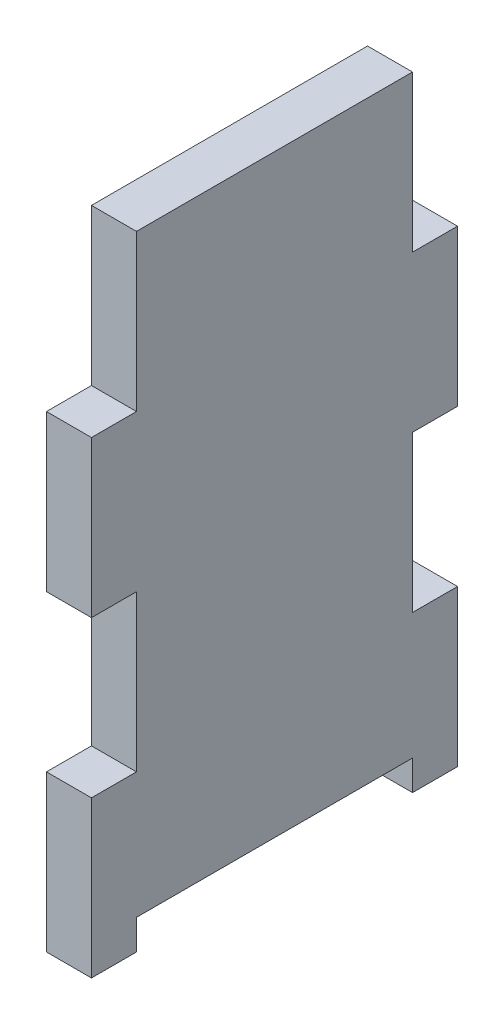
ISO-10303-21;
HEADER;
FILE_DESCRIPTION(('STEP AP214'),'2;1');
FILE_NAME('part.step','',(''),(''),'','','');
FILE_SCHEMA(('AUTOMOTIVE_DESIGN { 1 0 10303 214 1 1 1 1 }'));
ENDSEC;
DATA;
#1=APPLICATION_CONTEXT('core data for automotive mechanical design processes');
#2=APPLICATION_PROTOCOL_DEFINITION('international standard','automotive_design',2000,#1);
#3=PRODUCT_CONTEXT('',#1,'mechanical');
#4=PRODUCT('Part','Part','',(#3));
#5=PRODUCT_RELATED_PRODUCT_CATEGORY('part','',(#4));
#6=PRODUCT_DEFINITION_FORMATION('','',#4);
#7=PRODUCT_DEFINITION_CONTEXT('part definition',#1,'design');
#8=PRODUCT_DEFINITION('design','',#6,#7);
#9=PRODUCT_DEFINITION_SHAPE('','',#8);
#10=(LENGTH_UNIT() NAMED_UNIT(*) SI_UNIT(.MILLI.,.METRE.));
#11=(NAMED_UNIT(*) PLANE_ANGLE_UNIT() SI_UNIT($,.RADIAN.));
#12=(NAMED_UNIT(*) SI_UNIT($,.STERADIAN.) SOLID_ANGLE_UNIT());
#13=UNCERTAINTY_MEASURE_WITH_UNIT(LENGTH_MEASURE(1.E-05),#10,'distance_accuracy_value','');
#14=(GEOMETRIC_REPRESENTATION_CONTEXT(3) GLOBAL_UNCERTAINTY_ASSIGNED_CONTEXT((#13)) GLOBAL_UNIT_ASSIGNED_CONTEXT((#10,
#11,#12)) REPRESENTATION_CONTEXT('',''));
#15=CARTESIAN_POINT('',(0.,0.,0.));
#16=DIRECTION('',(0.,0.,1.));
#17=DIRECTION('',(1.,0.,0.));
#18=AXIS2_PLACEMENT_3D('',#15,#16,#17);
#19=CARTESIAN_POINT('',(9.525,-132.08,0.));
#20=DIRECTION('',(0.,1.,0.));
#21=DIRECTION('',(0.,0.,1.));
#22=AXIS2_PLACEMENT_3D('',#19,#20,#21);
#23=PLANE('',#22);
#24=DIRECTION('',(0.,0.,-1.));
#25=VECTOR('',#24,1.);
#26=CARTESIAN_POINT('',(0.,-132.08,0.));
#27=LINE('',#26,#25);
#28=CARTESIAN_POINT('',(0.,-132.08,0.));
#29=VERTEX_POINT('',#28);
#30=CARTESIAN_POINT('',(0.,-132.08,-9.52500000000001));
#31=VERTEX_POINT('',#30);
#32=EDGE_CURVE('E228',#29,#31,#27,.T.);
#33=ORIENTED_EDGE('',*,*,#32,.T.);
#34=DIRECTION('',(1.,0.,0.));
#35=VECTOR('',#34,1.);
#36=CARTESIAN_POINT('',(-37.465,-132.08,-9.52500000000001));
#37=LINE('',#36,#35);
#38=CARTESIAN_POINT('',(9.525,-132.08,-9.52500000000001));
#39=VERTEX_POINT('',#38);
#40=EDGE_CURVE('E336',#31,#39,#37,.T.);
#41=ORIENTED_EDGE('',*,*,#40,.T.);
#42=DIRECTION('',(0.,0.,-1.));
#43=VECTOR('',#42,1.);
#44=CARTESIAN_POINT('',(9.525,-132.08,0.));
#45=LINE('',#44,#43);
#46=CARTESIAN_POINT('',(9.525,-132.08,0.));
#47=VERTEX_POINT('',#46);
#48=EDGE_CURVE('E364',#47,#39,#45,.T.);
#49=ORIENTED_EDGE('',*,*,#48,.F.);
#50=DIRECTION('',(-1.,0.,0.));
#51=VECTOR('',#50,1.);
#52=CARTESIAN_POINT('',(9.525,-132.08,0.));
#53=LINE('',#52,#51);
#54=EDGE_CURVE('E276',#47,#29,#53,.T.);
#55=ORIENTED_EDGE('',*,*,#54,.T.);
#56=EDGE_LOOP('',(#33,#41,#49,#55));
#57=FACE_BOUND('',#56,.T.);
#58=ADVANCED_FACE('F38',(#57),#23,.F.);
#59=CARTESIAN_POINT('',(9.525,0.,0.));
#60=DIRECTION('',(0.,1.,0.));
#61=DIRECTION('',(0.,0.,1.));
#62=AXIS2_PLACEMENT_3D('',#59,#60,#61);
#63=PLANE('',#62);
#64=DIRECTION('',(0.,0.,-1.));
#65=VECTOR('',#64,1.);
#66=CARTESIAN_POINT('',(0.,0.,0.));
#67=LINE('',#66,#65);
#68=CARTESIAN_POINT('',(0.,0.,-9.525));
#69=VERTEX_POINT('',#68);
#70=CARTESIAN_POINT('',(0.,0.,-67.945));
#71=VERTEX_POINT('',#70);
#72=EDGE_CURVE('E201',#69,#71,#67,.T.);
#73=ORIENTED_EDGE('',*,*,#72,.F.);
#74=DIRECTION('',(-1.,0.,0.));
#75=VECTOR('',#74,1.);
#76=CARTESIAN_POINT('',(9.525,0.,-9.525));
#77=LINE('',#76,#75);
#78=CARTESIAN_POINT('',(9.525,0.,-9.525));
#79=VERTEX_POINT('',#78);
#80=EDGE_CURVE('E123',#79,#69,#77,.T.);
#81=ORIENTED_EDGE('',*,*,#80,.F.);
#82=DIRECTION('',(0.,0.,-1.));
#83=VECTOR('',#82,1.);
#84=CARTESIAN_POINT('',(9.525,0.,0.));
#85=LINE('',#84,#83);
#86=CARTESIAN_POINT('',(9.525,0.,-67.945));
#87=VERTEX_POINT('',#86);
#88=EDGE_CURVE('E254',#79,#87,#85,.T.);
#89=ORIENTED_EDGE('',*,*,#88,.T.);
#90=DIRECTION('',(-1.,0.,0.));
#91=VECTOR('',#90,1.);
#92=CARTESIAN_POINT('',(9.525,0.,-67.945));
#93=LINE('',#92,#91);
#94=EDGE_CURVE('E63',#87,#71,#93,.T.);
#95=ORIENTED_EDGE('',*,*,#94,.T.);
#96=EDGE_LOOP('',(#73,#81,#89,#95));
#97=FACE_BOUND('',#96,.T.);
#98=ADVANCED_FACE('F40',(#97),#63,.T.);
#99=CARTESIAN_POINT('',(9.525,0.,-9.525));
#100=DIRECTION('',(0.,0.,-1.));
#101=DIRECTION('',(0.,1.,0.));
#102=AXIS2_PLACEMENT_3D('',#99,#100,#101);
#103=PLANE('',#102);
#104=DIRECTION('',(0.,-1.,0.));
#105=VECTOR('',#104,1.);
#106=CARTESIAN_POINT('',(0.,0.,-9.525));
#107=LINE('',#106,#105);
#108=CARTESIAN_POINT('',(0.,-33.02,-9.52499999999999));
#109=VERTEX_POINT('',#108);
#110=EDGE_CURVE('E204',#69,#109,#107,.T.);
#111=ORIENTED_EDGE('',*,*,#110,.T.);
#112=DIRECTION('',(-1.,0.,0.));
#113=VECTOR('',#112,1.);
#114=CARTESIAN_POINT('',(9.525,-33.02,-9.52499999999999));
#115=LINE('',#114,#113);
#116=CARTESIAN_POINT('',(9.525,-33.02,-9.52499999999999));
#117=VERTEX_POINT('',#116);
#118=EDGE_CURVE('E296',#117,#109,#115,.T.);
#119=ORIENTED_EDGE('',*,*,#118,.F.);
#120=DIRECTION('',(0.,-1.,0.));
#121=VECTOR('',#120,1.);
#122=CARTESIAN_POINT('',(9.525,0.,-9.525));
#123=LINE('',#122,#121);
#124=EDGE_CURVE('E342',#79,#117,#123,.T.);
#125=ORIENTED_EDGE('',*,*,#124,.F.);
#126=ORIENTED_EDGE('',*,*,#80,.T.);
#127=EDGE_LOOP('',(#111,#119,#125,#126));
#128=FACE_BOUND('',#127,.T.);
#129=ADVANCED_FACE('F443',(#128),#103,.F.);
#130=CARTESIAN_POINT('',(9.525,-33.02,0.));
#131=DIRECTION('',(0.,-1.,0.));
#132=DIRECTION('',(0.,0.,-1.));
#133=AXIS2_PLACEMENT_3D('',#130,#131,#132);
#134=PLANE('',#133);
#135=DIRECTION('',(0.,0.,1.));
#136=VECTOR('',#135,1.);
#137=CARTESIAN_POINT('',(0.,-33.02,0.));
#138=LINE('',#137,#136);
#139=CARTESIAN_POINT('',(0.,-33.02,0.));
#140=VERTEX_POINT('',#139);
#141=EDGE_CURVE('E208',#109,#140,#138,.T.);
#142=ORIENTED_EDGE('',*,*,#141,.T.);
#143=DIRECTION('',(-1.,0.,0.));
#144=VECTOR('',#143,1.);
#145=CARTESIAN_POINT('',(9.525,-33.02,0.));
#146=LINE('',#145,#144);
#147=CARTESIAN_POINT('',(9.525,-33.02,0.));
#148=VERTEX_POINT('',#147);
#149=EDGE_CURVE('E292',#148,#140,#146,.T.);
#150=ORIENTED_EDGE('',*,*,#149,.F.);
#151=DIRECTION('',(0.,0.,1.));
#152=VECTOR('',#151,1.);
#153=CARTESIAN_POINT('',(9.525,-33.02,0.));
#154=LINE('',#153,#152);
#155=EDGE_CURVE('E345',#117,#148,#154,.T.);
#156=ORIENTED_EDGE('',*,*,#155,.F.);
#157=ORIENTED_EDGE('',*,*,#118,.T.);
#158=EDGE_LOOP('',(#142,#150,#156,#157));
#159=FACE_BOUND('',#158,.T.);
#160=ADVANCED_FACE('F459',(#159),#134,.F.);
#161=CARTESIAN_POINT('',(9.525,0.,0.));
#162=DIRECTION('',(0.,0.,-1.));
#163=DIRECTION('',(0.,1.,0.));
#164=AXIS2_PLACEMENT_3D('',#161,#162,#163);
#165=PLANE('',#164);
#166=DIRECTION('',(0.,-1.,0.));
#167=VECTOR('',#166,1.);
#168=CARTESIAN_POINT('',(0.,0.,0.));
#169=LINE('',#168,#167);
#170=CARTESIAN_POINT('',(0.,-66.04,0.));
#171=VERTEX_POINT('',#170);
#172=EDGE_CURVE('E211',#140,#171,#169,.T.);
#173=ORIENTED_EDGE('',*,*,#172,.T.);
#174=DIRECTION('',(-1.,0.,0.));
#175=VECTOR('',#174,1.);
#176=CARTESIAN_POINT('',(9.525,-66.04,0.));
#177=LINE('',#176,#175);
#178=CARTESIAN_POINT('',(9.525,-66.04,0.));
#179=VERTEX_POINT('',#178);
#180=EDGE_CURVE('E289',#179,#171,#177,.T.);
#181=ORIENTED_EDGE('',*,*,#180,.F.);
#182=DIRECTION('',(0.,-1.,0.));
#183=VECTOR('',#182,1.);
#184=CARTESIAN_POINT('',(9.525,0.,0.));
#185=LINE('',#184,#183);
#186=EDGE_CURVE('E348',#148,#179,#185,.T.);
#187=ORIENTED_EDGE('',*,*,#186,.F.);
#188=ORIENTED_EDGE('',*,*,#149,.T.);
#189=EDGE_LOOP('',(#173,#181,#187,#188));
#190=FACE_BOUND('',#189,.T.);
#191=ADVANCED_FACE('F450',(#190),#165,.F.);
#192=CARTESIAN_POINT('',(9.525,-66.04,0.));
#193=DIRECTION('',(0.,-1.,0.));
#194=DIRECTION('',(0.,0.,-1.));
#195=AXIS2_PLACEMENT_3D('',#192,#193,#194);
#196=PLANE('',#195);
#197=DIRECTION('',(0.,0.,1.));
#198=VECTOR('',#197,1.);
#199=CARTESIAN_POINT('',(0.,-66.04,0.));
#200=LINE('',#199,#198);
#201=CARTESIAN_POINT('',(0.,-66.04,-9.52500000000001));
#202=VERTEX_POINT('',#201);
#203=EDGE_CURVE('E215',#202,#171,#200,.T.);
#204=ORIENTED_EDGE('',*,*,#203,.F.);
#205=DIRECTION('',(-1.,0.,0.));
#206=VECTOR('',#205,1.);
#207=CARTESIAN_POINT('',(9.525,-66.04,-9.52500000000001));
#208=LINE('',#207,#206);
#209=CARTESIAN_POINT('',(9.525,-66.04,-9.52500000000001));
#210=VERTEX_POINT('',#209);
#211=EDGE_CURVE('E286',#210,#202,#208,.T.);
#212=ORIENTED_EDGE('',*,*,#211,.F.);
#213=DIRECTION('',(0.,0.,1.));
#214=VECTOR('',#213,1.);
#215=CARTESIAN_POINT('',(9.525,-66.04,0.));
#216=LINE('',#215,#214);
#217=EDGE_CURVE('E351',#210,#179,#216,.T.);
#218=ORIENTED_EDGE('',*,*,#217,.T.);
#219=ORIENTED_EDGE('',*,*,#180,.T.);
#220=EDGE_LOOP('',(#204,#212,#218,#219));
#221=FACE_BOUND('',#220,.T.);
#222=ADVANCED_FACE('F458',(#221),#196,.T.);
#223=CARTESIAN_POINT('',(9.525,0.,-9.52500000000001));
#224=DIRECTION('',(0.,0.,1.));
#225=DIRECTION('',(1.,0.,0.));
#226=AXIS2_PLACEMENT_3D('',#223,#224,#225);
#227=PLANE('',#226);
#228=DIRECTION('',(0.,1.,0.));
#229=VECTOR('',#228,1.);
#230=CARTESIAN_POINT('',(0.,0.,-9.52500000000001));
#231=LINE('',#230,#229);
#232=CARTESIAN_POINT('',(0.,-99.06,-9.52500000000001));
#233=VERTEX_POINT('',#232);
#234=EDGE_CURVE('E220',#233,#202,#231,.T.);
#235=ORIENTED_EDGE('',*,*,#234,.F.);
#236=DIRECTION('',(-1.,0.,0.));
#237=VECTOR('',#236,1.);
#238=CARTESIAN_POINT('',(9.525,-99.06,-9.52500000000001));
#239=LINE('',#238,#237);
#240=CARTESIAN_POINT('',(9.525,-99.06,-9.52500000000001));
#241=VERTEX_POINT('',#240);
#242=EDGE_CURVE('E283',#241,#233,#239,.T.);
#243=ORIENTED_EDGE('',*,*,#242,.F.);
#244=DIRECTION('',(0.,1.,0.));
#245=VECTOR('',#244,1.);
#246=CARTESIAN_POINT('',(9.525,0.,-9.52500000000001));
#247=LINE('',#246,#245);
#248=EDGE_CURVE('E356',#241,#210,#247,.T.);
#249=ORIENTED_EDGE('',*,*,#248,.T.);
#250=ORIENTED_EDGE('',*,*,#211,.T.);
#251=EDGE_LOOP('',(#235,#243,#249,#250));
#252=FACE_BOUND('',#251,.T.);
#253=ADVANCED_FACE('F454',(#252),#227,.T.);
#254=CARTESIAN_POINT('',(9.525,-99.06,0.));
#255=DIRECTION('',(0.,1.,0.));
#256=DIRECTION('',(0.,0.,1.));
#257=AXIS2_PLACEMENT_3D('',#254,#255,#256);
#258=PLANE('',#257);
#259=DIRECTION('',(0.,0.,-1.));
#260=VECTOR('',#259,1.);
#261=CARTESIAN_POINT('',(0.,-99.06,0.));
#262=LINE('',#261,#260);
#263=CARTESIAN_POINT('',(0.,-99.06,0.));
#264=VERTEX_POINT('',#263);
#265=EDGE_CURVE('E224',#264,#233,#262,.T.);
#266=ORIENTED_EDGE('',*,*,#265,.F.);
#267=DIRECTION('',(-1.,0.,0.));
#268=VECTOR('',#267,1.);
#269=CARTESIAN_POINT('',(9.525,-99.06,0.));
#270=LINE('',#269,#268);
#271=CARTESIAN_POINT('',(9.525,-99.06,0.));
#272=VERTEX_POINT('',#271);
#273=EDGE_CURVE('E280',#272,#264,#270,.T.);
#274=ORIENTED_EDGE('',*,*,#273,.F.);
#275=DIRECTION('',(0.,0.,-1.));
#276=VECTOR('',#275,1.);
#277=CARTESIAN_POINT('',(9.525,-99.06,0.));
#278=LINE('',#277,#276);
#279=EDGE_CURVE('E360',#272,#241,#278,.T.);
#280=ORIENTED_EDGE('',*,*,#279,.T.);
#281=ORIENTED_EDGE('',*,*,#242,.T.);
#282=EDGE_LOOP('',(#266,#274,#280,#281));
#283=FACE_BOUND('',#282,.T.);
#284=ADVANCED_FACE('F449',(#283),#258,.T.);
#285=EDGE_CURVE('E216',#264,#29,#169,.T.);
#286=ORIENTED_EDGE('',*,*,#285,.T.);
#287=ORIENTED_EDGE('',*,*,#54,.F.);
#288=EDGE_CURVE('E352',#272,#47,#185,.T.);
#289=ORIENTED_EDGE('',*,*,#288,.F.);
#290=ORIENTED_EDGE('',*,*,#273,.T.);
#291=EDGE_LOOP('',(#286,#287,#289,#290));
#292=FACE_BOUND('',#291,.T.);
#293=ADVANCED_FACE('F393',(#292),#165,.F.);
#294=CARTESIAN_POINT('',(9.525,-132.08,-67.945));
#295=VERTEX_POINT('',#294);
#296=CARTESIAN_POINT('',(9.525,-132.08,-77.47));
#297=VERTEX_POINT('',#296);
#298=EDGE_CURVE('E367',#295,#297,#45,.T.);
#299=ORIENTED_EDGE('',*,*,#298,.F.);
#300=DIRECTION('',(1.,0.,0.));
#301=VECTOR('',#300,1.);
#302=CARTESIAN_POINT('',(-37.465,-132.08,-67.945));
#303=LINE('',#302,#301);
#304=CARTESIAN_POINT('',(0.,-132.08,-67.945));
#305=VERTEX_POINT('',#304);
#306=EDGE_CURVE('E328',#305,#295,#303,.T.);
#307=ORIENTED_EDGE('',*,*,#306,.F.);
#308=CARTESIAN_POINT('',(0.,-132.08,-77.47));
#309=VERTEX_POINT('',#308);
#310=EDGE_CURVE('E233',#305,#309,#27,.T.);
#311=ORIENTED_EDGE('',*,*,#310,.T.);
#312=DIRECTION('',(-1.,0.,0.));
#313=VECTOR('',#312,1.);
#314=CARTESIAN_POINT('',(9.525,-132.08,-77.47));
#315=LINE('',#314,#313);
#316=EDGE_CURVE('E272',#297,#309,#315,.T.);
#317=ORIENTED_EDGE('',*,*,#316,.F.);
#318=EDGE_LOOP('',(#299,#307,#311,#317));
#319=FACE_BOUND('',#318,.T.);
#320=ADVANCED_FACE('F413',(#319),#23,.F.);
#321=CARTESIAN_POINT('',(9.525,0.,-77.47));
#322=DIRECTION('',(0.,0.,-1.));
#323=DIRECTION('',(-1.,0.,0.));
#324=AXIS2_PLACEMENT_3D('',#321,#322,#323);
#325=PLANE('',#324);
#326=DIRECTION('',(0.,-1.,0.));
#327=VECTOR('',#326,1.);
#328=CARTESIAN_POINT('',(0.,0.,-77.47));
#329=LINE('',#328,#327);
#330=CARTESIAN_POINT('',(0.,-99.06,-77.47));
#331=VERTEX_POINT('',#330);
#332=EDGE_CURVE('E232',#331,#309,#329,.T.);
#333=ORIENTED_EDGE('',*,*,#332,.F.);
#334=DIRECTION('',(-1.,0.,0.));
#335=VECTOR('',#334,1.);
#336=CARTESIAN_POINT('',(9.525,-99.06,-77.47));
#337=LINE('',#336,#335);
#338=CARTESIAN_POINT('',(9.525,-99.06,-77.47));
#339=VERTEX_POINT('',#338);
#340=EDGE_CURVE('E269',#339,#331,#337,.T.);
#341=ORIENTED_EDGE('',*,*,#340,.F.);
#342=DIRECTION('',(0.,-1.,0.));
#343=VECTOR('',#342,1.);
#344=CARTESIAN_POINT('',(9.525,0.,-77.47));
#345=LINE('',#344,#343);
#346=EDGE_CURVE('E191',#339,#297,#345,.T.);
#347=ORIENTED_EDGE('',*,*,#346,.T.);
#348=ORIENTED_EDGE('',*,*,#316,.T.);
#349=EDGE_LOOP('',(#333,#341,#347,#348));
#350=FACE_BOUND('',#349,.T.);
#351=ADVANCED_FACE('F418',(#350),#325,.T.);
#352=CARTESIAN_POINT('',(9.525,-99.06,0.));
#353=DIRECTION('',(0.,-1.,0.));
#354=DIRECTION('',(0.,0.,-1.));
#355=AXIS2_PLACEMENT_3D('',#352,#353,#354);
#356=PLANE('',#355);
#357=DIRECTION('',(0.,0.,1.));
#358=VECTOR('',#357,1.);
#359=CARTESIAN_POINT('',(0.,-99.06,0.));
#360=LINE('',#359,#358);
#361=CARTESIAN_POINT('',(0.,-99.06,-67.945));
#362=VERTEX_POINT('',#361);
#363=EDGE_CURVE('E237',#331,#362,#360,.T.);
#364=ORIENTED_EDGE('',*,*,#363,.T.);
#365=DIRECTION('',(-1.,0.,0.));
#366=VECTOR('',#365,1.);
#367=CARTESIAN_POINT('',(9.525,-99.06,-67.945));
#368=LINE('',#367,#366);
#369=CARTESIAN_POINT('',(9.525,-99.06,-67.945));
#370=VERTEX_POINT('',#369);
#371=EDGE_CURVE('E265',#370,#362,#368,.T.);
#372=ORIENTED_EDGE('',*,*,#371,.F.);
#373=DIRECTION('',(0.,0.,1.));
#374=VECTOR('',#373,1.);
#375=CARTESIAN_POINT('',(9.525,-99.06,0.));
#376=LINE('',#375,#374);
#377=EDGE_CURVE('E371',#339,#370,#376,.T.);
#378=ORIENTED_EDGE('',*,*,#377,.F.);
#379=ORIENTED_EDGE('',*,*,#340,.T.);
#380=EDGE_LOOP('',(#364,#372,#378,#379));
#381=FACE_BOUND('',#380,.T.);
#382=ADVANCED_FACE('F427',(#381),#356,.F.);
#383=CARTESIAN_POINT('',(9.525,0.,-67.945));
#384=DIRECTION('',(0.,0.,1.));
#385=DIRECTION('',(1.,0.,0.));
#386=AXIS2_PLACEMENT_3D('',#383,#384,#385);
#387=PLANE('',#386);
#388=DIRECTION('',(0.,1.,0.));
#389=VECTOR('',#388,1.);
#390=CARTESIAN_POINT('',(0.,0.,-67.945));
#391=LINE('',#390,#389);
#392=CARTESIAN_POINT('',(0.,-66.04,-67.945));
#393=VERTEX_POINT('',#392);
#394=EDGE_CURVE('E240',#362,#393,#391,.T.);
#395=ORIENTED_EDGE('',*,*,#394,.T.);
#396=DIRECTION('',(-1.,0.,0.));
#397=VECTOR('',#396,1.);
#398=CARTESIAN_POINT('',(9.525,-66.04,-67.945));
#399=LINE('',#398,#397);
#400=CARTESIAN_POINT('',(9.525,-66.04,-67.945));
#401=VERTEX_POINT('',#400);
#402=EDGE_CURVE('E261',#401,#393,#399,.T.);
#403=ORIENTED_EDGE('',*,*,#402,.F.);
#404=DIRECTION('',(0.,1.,0.));
#405=VECTOR('',#404,1.);
#406=CARTESIAN_POINT('',(9.525,0.,-67.945));
#407=LINE('',#406,#405);
#408=EDGE_CURVE('E373',#370,#401,#407,.T.);
#409=ORIENTED_EDGE('',*,*,#408,.F.);
#410=ORIENTED_EDGE('',*,*,#371,.T.);
#411=EDGE_LOOP('',(#395,#403,#409,#410));
#412=FACE_BOUND('',#411,.T.);
#413=ADVANCED_FACE('F382',(#412),#387,.F.);
#414=CARTESIAN_POINT('',(9.525,-66.04,0.));
#415=DIRECTION('',(0.,1.,0.));
#416=DIRECTION('',(0.,0.,1.));
#417=AXIS2_PLACEMENT_3D('',#414,#415,#416);
#418=PLANE('',#417);
#419=DIRECTION('',(0.,0.,-1.));
#420=VECTOR('',#419,1.);
#421=CARTESIAN_POINT('',(0.,-66.04,0.));
#422=LINE('',#421,#420);
#423=CARTESIAN_POINT('',(0.,-66.04,-77.47));
#424=VERTEX_POINT('',#423);
#425=EDGE_CURVE('E243',#393,#424,#422,.T.);
#426=ORIENTED_EDGE('',*,*,#425,.T.);
#427=DIRECTION('',(-1.,0.,0.));
#428=VECTOR('',#427,1.);
#429=CARTESIAN_POINT('',(9.525,-66.04,-77.47));
#430=LINE('',#429,#428);
#431=CARTESIAN_POINT('',(9.525,-66.04,-77.47));
#432=VERTEX_POINT('',#431);
#433=EDGE_CURVE('E177',#432,#424,#430,.T.);
#434=ORIENTED_EDGE('',*,*,#433,.F.);
#435=DIRECTION('',(0.,0.,-1.));
#436=VECTOR('',#435,1.);
#437=CARTESIAN_POINT('',(9.525,-66.04,0.));
#438=LINE('',#437,#436);
#439=EDGE_CURVE('E187',#401,#432,#438,.T.);
#440=ORIENTED_EDGE('',*,*,#439,.F.);
#441=ORIENTED_EDGE('',*,*,#402,.T.);
#442=EDGE_LOOP('',(#426,#434,#440,#441));
#443=FACE_BOUND('',#442,.T.);
#444=ADVANCED_FACE('F386',(#443),#418,.F.);
#445=CARTESIAN_POINT('',(0.,-33.02,-77.47));
#446=VERTEX_POINT('',#445);
#447=EDGE_CURVE('E171',#446,#424,#329,.T.);
#448=ORIENTED_EDGE('',*,*,#447,.F.);
#449=DIRECTION('',(-1.,0.,0.));
#450=VECTOR('',#449,1.);
#451=CARTESIAN_POINT('',(9.525,-33.02,-77.47));
#452=LINE('',#451,#450);
#453=CARTESIAN_POINT('',(9.525,-33.02,-77.47));
#454=VERTEX_POINT('',#453);
#455=EDGE_CURVE('E166',#454,#446,#452,.T.);
#456=ORIENTED_EDGE('',*,*,#455,.F.);
#457=EDGE_CURVE('E169',#454,#432,#345,.T.);
#458=ORIENTED_EDGE('',*,*,#457,.T.);
#459=ORIENTED_EDGE('',*,*,#433,.T.);
#460=EDGE_LOOP('',(#448,#456,#458,#459));
#461=FACE_BOUND('',#460,.T.);
#462=ADVANCED_FACE('F168',(#461),#325,.T.);
#463=CARTESIAN_POINT('',(9.525,-33.02,0.));
#464=DIRECTION('',(0.,1.,0.));
#465=DIRECTION('',(0.,0.,1.));
#466=AXIS2_PLACEMENT_3D('',#463,#464,#465);
#467=PLANE('',#466);
#468=DIRECTION('',(0.,0.,-1.));
#469=VECTOR('',#468,1.);
#470=CARTESIAN_POINT('',(0.,-33.02,0.));
#471=LINE('',#470,#469);
#472=CARTESIAN_POINT('',(0.,-33.02,-67.945));
#473=VERTEX_POINT('',#472);
#474=EDGE_CURVE('E247',#473,#446,#471,.T.);
#475=ORIENTED_EDGE('',*,*,#474,.F.);
#476=DIRECTION('',(-1.,0.,0.));
#477=VECTOR('',#476,1.);
#478=CARTESIAN_POINT('',(9.525,-33.02,-67.945));
#479=LINE('',#478,#477);
#480=CARTESIAN_POINT('',(9.525,-33.02,-67.945));
#481=VERTEX_POINT('',#480);
#482=EDGE_CURVE('E178',#481,#473,#479,.T.);
#483=ORIENTED_EDGE('',*,*,#482,.F.);
#484=DIRECTION('',(0.,0.,-1.));
#485=VECTOR('',#484,1.);
#486=CARTESIAN_POINT('',(9.525,-33.02,0.));
#487=LINE('',#486,#485);
#488=EDGE_CURVE('E185',#481,#454,#487,.T.);
#489=ORIENTED_EDGE('',*,*,#488,.T.);
#490=ORIENTED_EDGE('',*,*,#455,.T.);
#491=EDGE_LOOP('',(#475,#483,#489,#490));
#492=FACE_BOUND('',#491,.T.);
#493=ADVANCED_FACE('F192',(#492),#467,.T.);
#494=CARTESIAN_POINT('',(9.525,0.,-67.945));
#495=DIRECTION('',(0.,0.,-1.));
#496=DIRECTION('',(-1.,0.,0.));
#497=AXIS2_PLACEMENT_3D('',#494,#495,#496);
#498=PLANE('',#497);
#499=DIRECTION('',(0.,-1.,0.));
#500=VECTOR('',#499,1.);
#501=CARTESIAN_POINT('',(0.,0.,-67.945));
#502=LINE('',#501,#500);
#503=EDGE_CURVE('E250',#71,#473,#502,.T.);
#504=ORIENTED_EDGE('',*,*,#503,.F.);
#505=ORIENTED_EDGE('',*,*,#94,.F.);
#506=DIRECTION('',(0.,-1.,0.));
#507=VECTOR('',#506,1.);
#508=CARTESIAN_POINT('',(9.525,0.,-67.945));
#509=LINE('',#508,#507);
#510=EDGE_CURVE('E194',#87,#481,#509,.T.);
#511=ORIENTED_EDGE('',*,*,#510,.T.);
#512=ORIENTED_EDGE('',*,*,#482,.T.);
#513=EDGE_LOOP('',(#504,#505,#511,#512));
#514=FACE_BOUND('',#513,.T.);
#515=ADVANCED_FACE('F491',(#514),#498,.T.);
#516=CARTESIAN_POINT('',(9.525,0.,0.));
#517=DIRECTION('',(1.,0.,0.));
#518=DIRECTION('',(0.,0.,-1.));
#519=AXIS2_PLACEMENT_3D('',#516,#517,#518);
#520=PLANE('',#519);
#521=DIRECTION('',(0.,-1.,0.));
#522=VECTOR('',#521,1.);
#523=CARTESIAN_POINT('',(9.525,-132.08,-9.52500000000001));
#524=LINE('',#523,#522);
#525=CARTESIAN_POINT('',(9.525,-125.73,-9.52500000000001));
#526=VERTEX_POINT('',#525);
#527=EDGE_CURVE('E400',#526,#39,#524,.T.);
#528=ORIENTED_EDGE('',*,*,#527,.F.);
#529=DIRECTION('',(0.,0.,1.));
#530=VECTOR('',#529,1.);
#531=CARTESIAN_POINT('',(9.525,-125.73,-9.52500000000001));
#532=LINE('',#531,#530);
#533=CARTESIAN_POINT('',(9.525,-125.73,-67.945));
#534=VERTEX_POINT('',#533);
#535=EDGE_CURVE('E322',#534,#526,#532,.T.);
#536=ORIENTED_EDGE('',*,*,#535,.F.);
#537=DIRECTION('',(0.,1.,0.));
#538=VECTOR('',#537,1.);
#539=CARTESIAN_POINT('',(9.525,-132.08,-67.945));
#540=LINE('',#539,#538);
#541=EDGE_CURVE('E419',#295,#534,#540,.T.);
#542=ORIENTED_EDGE('',*,*,#541,.F.);
#543=ORIENTED_EDGE('',*,*,#298,.T.);
#544=ORIENTED_EDGE('',*,*,#346,.F.);
#545=ORIENTED_EDGE('',*,*,#377,.T.);
#546=ORIENTED_EDGE('',*,*,#408,.T.);
#547=ORIENTED_EDGE('',*,*,#439,.T.);
#548=ORIENTED_EDGE('',*,*,#457,.F.);
#549=ORIENTED_EDGE('',*,*,#488,.F.);
#550=ORIENTED_EDGE('',*,*,#510,.F.);
#551=ORIENTED_EDGE('',*,*,#88,.F.);
#552=ORIENTED_EDGE('',*,*,#124,.T.);
#553=ORIENTED_EDGE('',*,*,#155,.T.);
#554=ORIENTED_EDGE('',*,*,#186,.T.);
#555=ORIENTED_EDGE('',*,*,#217,.F.);
#556=ORIENTED_EDGE('',*,*,#248,.F.);
#557=ORIENTED_EDGE('',*,*,#279,.F.);
#558=ORIENTED_EDGE('',*,*,#288,.T.);
#559=ORIENTED_EDGE('',*,*,#48,.T.);
#560=EDGE_LOOP('',(#528,#536,#542,#543,#544,#545,#546,#547,#548,#549,#550,#551,#552,#553,#554,
#555,#556,#557,#558,#559));
#561=FACE_BOUND('',#560,.T.);
#562=ADVANCED_FACE('F183',(#561),#520,.T.);
#563=CARTESIAN_POINT('',(0.,0.,0.));
#564=DIRECTION('',(1.,0.,0.));
#565=DIRECTION('',(0.,0.,-1.));
#566=AXIS2_PLACEMENT_3D('',#563,#564,#565);
#567=PLANE('',#566);
#568=DIRECTION('',(0.,0.,1.));
#569=VECTOR('',#568,1.);
#570=CARTESIAN_POINT('',(0.,-125.73,0.));
#571=LINE('',#570,#569);
#572=CARTESIAN_POINT('',(0.,-125.73,-67.945));
#573=VERTEX_POINT('',#572);
#574=CARTESIAN_POINT('',(0.,-125.73,-9.52500000000001));
#575=VERTEX_POINT('',#574);
#576=EDGE_CURVE('E47',#573,#575,#571,.T.);
#577=ORIENTED_EDGE('',*,*,#576,.T.);
#578=DIRECTION('',(0.,-1.,0.));
#579=VECTOR('',#578,1.);
#580=CARTESIAN_POINT('',(0.,0.,-9.52500000000001));
#581=LINE('',#580,#579);
#582=EDGE_CURVE('E11',#575,#31,#581,.T.);
#583=ORIENTED_EDGE('',*,*,#582,.T.);
#584=ORIENTED_EDGE('',*,*,#32,.F.);
#585=ORIENTED_EDGE('',*,*,#285,.F.);
#586=ORIENTED_EDGE('',*,*,#265,.T.);
#587=ORIENTED_EDGE('',*,*,#234,.T.);
#588=ORIENTED_EDGE('',*,*,#203,.T.);
#589=ORIENTED_EDGE('',*,*,#172,.F.);
#590=ORIENTED_EDGE('',*,*,#141,.F.);
#591=ORIENTED_EDGE('',*,*,#110,.F.);
#592=ORIENTED_EDGE('',*,*,#72,.T.);
#593=ORIENTED_EDGE('',*,*,#503,.T.);
#594=ORIENTED_EDGE('',*,*,#474,.T.);
#595=ORIENTED_EDGE('',*,*,#447,.T.);
#596=ORIENTED_EDGE('',*,*,#425,.F.);
#597=ORIENTED_EDGE('',*,*,#394,.F.);
#598=ORIENTED_EDGE('',*,*,#363,.F.);
#599=ORIENTED_EDGE('',*,*,#332,.T.);
#600=ORIENTED_EDGE('',*,*,#310,.F.);
#601=DIRECTION('',(0.,1.,0.));
#602=VECTOR('',#601,1.);
#603=CARTESIAN_POINT('',(0.,0.,-67.945));
#604=LINE('',#603,#602);
#605=EDGE_CURVE('E302',#305,#573,#604,.T.);
#606=ORIENTED_EDGE('',*,*,#605,.T.);
#607=EDGE_LOOP('',(#577,#583,#584,#585,#586,#587,#588,#589,#590,#591,#592,#593,#594,#595,#596,
#597,#598,#599,#600,#606));
#608=FACE_BOUND('',#607,.T.);
#609=ADVANCED_FACE('F308',(#608),#567,.F.);
#610=CARTESIAN_POINT('',(-37.465,-132.08,-9.52500000000001));
#611=DIRECTION('',(0.,0.,1.));
#612=DIRECTION('',(1.,0.,0.));
#613=AXIS2_PLACEMENT_3D('',#610,#611,#612);
#614=PLANE('',#613);
#615=DIRECTION('',(1.,0.,0.));
#616=VECTOR('',#615,1.);
#617=CARTESIAN_POINT('',(-37.465,-125.73,-9.52500000000001));
#618=LINE('',#617,#616);
#619=EDGE_CURVE('E205',#575,#526,#618,.T.);
#620=ORIENTED_EDGE('',*,*,#619,.T.);
#621=ORIENTED_EDGE('',*,*,#527,.T.);
#622=ORIENTED_EDGE('',*,*,#40,.F.);
#623=ORIENTED_EDGE('',*,*,#582,.F.);
#624=EDGE_LOOP('',(#620,#621,#622,#623));
#625=FACE_BOUND('',#624,.T.);
#626=ADVANCED_FACE('F536',(#625),#614,.F.);
#627=CARTESIAN_POINT('',(-37.465,-125.73,-9.52500000000001));
#628=DIRECTION('',(0.,1.,0.));
#629=DIRECTION('',(0.,0.,1.));
#630=AXIS2_PLACEMENT_3D('',#627,#628,#629);
#631=PLANE('',#630);
#632=DIRECTION('',(1.,0.,0.));
#633=VECTOR('',#632,1.);
#634=CARTESIAN_POINT('',(-37.465,-125.73,-67.945));
#635=LINE('',#634,#633);
#636=EDGE_CURVE('E54',#573,#534,#635,.T.);
#637=ORIENTED_EDGE('',*,*,#636,.T.);
#638=ORIENTED_EDGE('',*,*,#535,.T.);
#639=ORIENTED_EDGE('',*,*,#619,.F.);
#640=ORIENTED_EDGE('',*,*,#576,.F.);
#641=EDGE_LOOP('',(#637,#638,#639,#640));
#642=FACE_BOUND('',#641,.T.);
#643=ADVANCED_FACE('F316',(#642),#631,.F.);
#644=CARTESIAN_POINT('',(-37.465,-132.08,-67.945));
#645=DIRECTION('',(0.,0.,-1.));
#646=DIRECTION('',(-1.,0.,0.));
#647=AXIS2_PLACEMENT_3D('',#644,#645,#646);
#648=PLANE('',#647);
#649=ORIENTED_EDGE('',*,*,#306,.T.);
#650=ORIENTED_EDGE('',*,*,#541,.T.);
#651=ORIENTED_EDGE('',*,*,#636,.F.);
#652=ORIENTED_EDGE('',*,*,#605,.F.);
#653=EDGE_LOOP('',(#649,#650,#651,#652));
#654=FACE_BOUND('',#653,.T.);
#655=ADVANCED_FACE('F409',(#654),#648,.F.);
#656=CLOSED_SHELL('',(#58,#98,#129,#160,#191,#222,#253,#284,#293,#320,#351,#382,#413,#444,#462,
#493,#515,#562,#609,#626,#643,#655));
#657=MANIFOLD_SOLID_BREP('B2',#656);
#658=ADVANCED_BREP_SHAPE_REPRESENTATION('',(#18,#657),#14);
#659=SHAPE_DEFINITION_REPRESENTATION(#9,#658);
ENDSEC;
END-ISO-10303-21;
